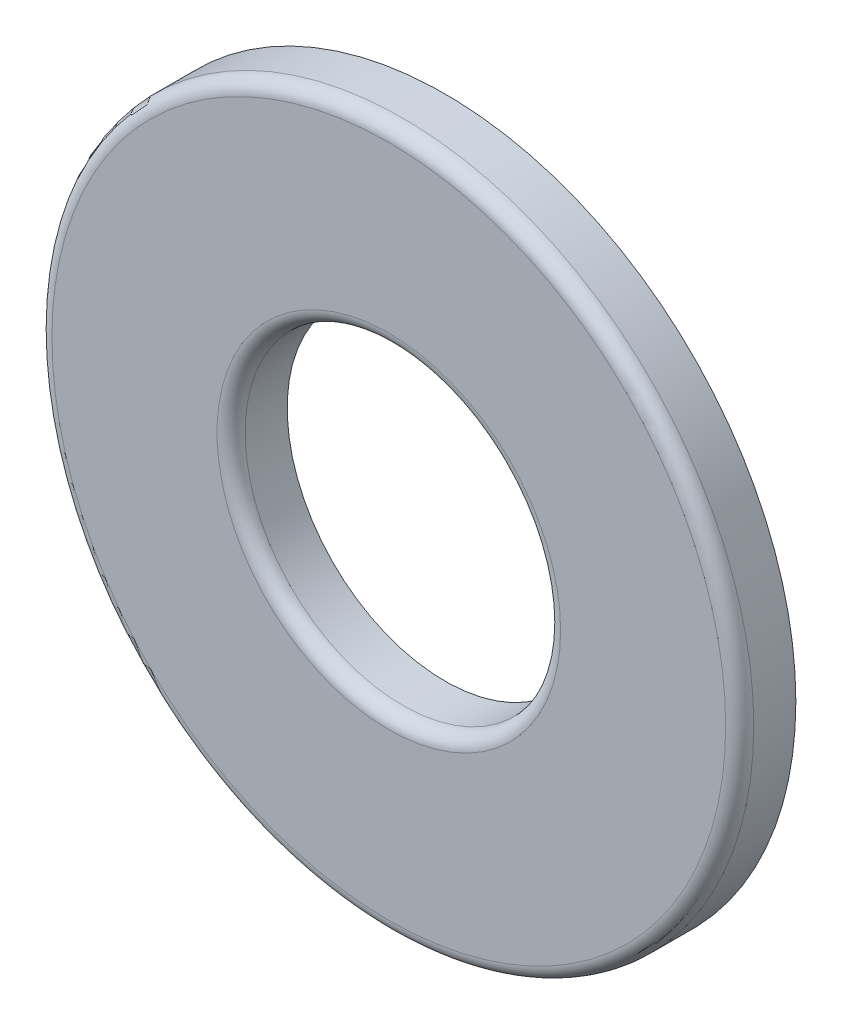
ISO-10303-21;
HEADER;
FILE_DESCRIPTION(('STEP AP214'),'2;1');
FILE_NAME('part.step','',(''),(''),'','','');
FILE_SCHEMA(('AUTOMOTIVE_DESIGN { 1 0 10303 214 1 1 1 1 }'));
ENDSEC;
DATA;
#1=APPLICATION_CONTEXT('core data for automotive mechanical design processes');
#2=APPLICATION_PROTOCOL_DEFINITION('international standard','automotive_design',2000,#1);
#3=PRODUCT_CONTEXT('',#1,'mechanical');
#4=PRODUCT('Part','Part','',(#3));
#5=PRODUCT_RELATED_PRODUCT_CATEGORY('part','',(#4));
#6=PRODUCT_DEFINITION_FORMATION('','',#4);
#7=PRODUCT_DEFINITION_CONTEXT('part definition',#1,'design');
#8=PRODUCT_DEFINITION('design','',#6,#7);
#9=PRODUCT_DEFINITION_SHAPE('','',#8);
#10=(LENGTH_UNIT() NAMED_UNIT(*) SI_UNIT(.MILLI.,.METRE.));
#11=(NAMED_UNIT(*) PLANE_ANGLE_UNIT() SI_UNIT($,.RADIAN.));
#12=(NAMED_UNIT(*) SI_UNIT($,.STERADIAN.) SOLID_ANGLE_UNIT());
#13=UNCERTAINTY_MEASURE_WITH_UNIT(LENGTH_MEASURE(1.E-05),#10,'distance_accuracy_value','');
#14=(GEOMETRIC_REPRESENTATION_CONTEXT(3) GLOBAL_UNCERTAINTY_ASSIGNED_CONTEXT((#13)) GLOBAL_UNIT_ASSIGNED_CONTEXT((#10,
#11,#12)) REPRESENTATION_CONTEXT('',''));
#15=CARTESIAN_POINT('',(0.,0.,0.));
#16=DIRECTION('',(0.,0.,1.));
#17=DIRECTION('',(1.,0.,0.));
#18=AXIS2_PLACEMENT_3D('',#15,#16,#17);
#19=CARTESIAN_POINT('',(0.,0.,0.634999999999997));
#20=DIRECTION('',(0.,0.,1.));
#21=DIRECTION('',(1.,0.,0.));
#22=AXIS2_PLACEMENT_3D('',#19,#20,#21);
#23=PLANE('',#22);
#24=CARTESIAN_POINT('',(0.,0.,0.634999999999997));
#25=DIRECTION('',(0.,0.,1.));
#26=DIRECTION('',(1.,0.,0.));
#27=AXIS2_PLACEMENT_3D('',#24,#25,#26);
#28=CIRCLE('',#27,7.62);
#29=CARTESIAN_POINT('',(7.62,0.,0.634999999999997));
#30=VERTEX_POINT('',#29);
#31=EDGE_CURVE('E48',#30,#30,#28,.T.);
#32=ORIENTED_EDGE('',*,*,#31,.T.);
#33=EDGE_LOOP('',(#32));
#34=FACE_BOUND('',#33,.T.);
#35=CARTESIAN_POINT('',(0.,0.,0.634999999999997));
#36=DIRECTION('',(0.,0.,1.));
#37=DIRECTION('',(1.,0.,0.));
#38=AXIS2_PLACEMENT_3D('',#35,#36,#37);
#39=CIRCLE('',#38,3.8862);
#40=CARTESIAN_POINT('',(3.8862,0.,0.634999999999997));
#41=VERTEX_POINT('',#40);
#42=EDGE_CURVE('E52',#41,#41,#39,.F.);
#43=ORIENTED_EDGE('',*,*,#42,.T.);
#44=EDGE_LOOP('',(#43));
#45=FACE_BOUND('',#44,.T.);
#46=ADVANCED_FACE('F37',(#34,#45),#23,.T.);
#47=CARTESIAN_POINT('',(0.,0.,0.634999999999997));
#48=DIRECTION('',(0.,0.,-1.));
#49=DIRECTION('',(-1.,0.,0.));
#50=AXIS2_PLACEMENT_3D('',#47,#48,#49);
#51=CYLINDRICAL_SURFACE('',#50,7.9375);
#52=CARTESIAN_POINT('',(0.,0.,0.317499999999997));
#53=DIRECTION('',(0.,0.,1.));
#54=DIRECTION('',(1.,0.,0.));
#55=AXIS2_PLACEMENT_3D('',#52,#53,#54);
#56=CIRCLE('',#55,7.9375);
#57=CARTESIAN_POINT('',(7.9375,0.,0.317499999999997));
#58=VERTEX_POINT('',#57);
#59=EDGE_CURVE('E44',#58,#58,#56,.F.);
#60=ORIENTED_EDGE('',*,*,#59,.T.);
#61=EDGE_LOOP('',(#60));
#62=FACE_BOUND('',#61,.T.);
#63=CARTESIAN_POINT('',(0.,0.,-0.635000000000003));
#64=DIRECTION('',(0.,0.,1.));
#65=DIRECTION('',(1.,0.,0.));
#66=AXIS2_PLACEMENT_3D('',#63,#64,#65);
#67=CIRCLE('',#66,7.9375);
#68=CARTESIAN_POINT('',(7.9375,0.,-0.635000000000003));
#69=VERTEX_POINT('',#68);
#70=EDGE_CURVE('E57',#69,#69,#67,.T.);
#71=ORIENTED_EDGE('',*,*,#70,.T.);
#72=EDGE_LOOP('',(#71));
#73=FACE_BOUND('',#72,.T.);
#74=ADVANCED_FACE('F69',(#62,#73),#51,.T.);
#75=CARTESIAN_POINT('',(0.,0.,0.634999999999997));
#76=DIRECTION('',(0.,0.,-1.));
#77=DIRECTION('',(-1.,0.,0.));
#78=AXIS2_PLACEMENT_3D('',#75,#76,#77);
#79=CYLINDRICAL_SURFACE('',#78,3.5687);
#80=CARTESIAN_POINT('',(0.,0.,0.317499999999997));
#81=DIRECTION('',(0.,0.,1.));
#82=DIRECTION('',(1.,0.,0.));
#83=AXIS2_PLACEMENT_3D('',#80,#81,#82);
#84=CIRCLE('',#83,3.5687);
#85=CARTESIAN_POINT('',(3.5687,0.,0.317499999999997));
#86=VERTEX_POINT('',#85);
#87=EDGE_CURVE('E10',#86,#86,#84,.T.);
#88=ORIENTED_EDGE('',*,*,#87,.T.);
#89=EDGE_LOOP('',(#88));
#90=FACE_BOUND('',#89,.T.);
#91=CARTESIAN_POINT('',(0.,0.,-0.635000000000003));
#92=DIRECTION('',(0.,0.,1.));
#93=DIRECTION('',(1.,0.,0.));
#94=AXIS2_PLACEMENT_3D('',#91,#92,#93);
#95=CIRCLE('',#94,3.5687);
#96=CARTESIAN_POINT('',(3.5687,0.,-0.635000000000003));
#97=VERTEX_POINT('',#96);
#98=EDGE_CURVE('E60',#97,#97,#95,.T.);
#99=ORIENTED_EDGE('',*,*,#98,.F.);
#100=EDGE_LOOP('',(#99));
#101=FACE_BOUND('',#100,.T.);
#102=ADVANCED_FACE('F67',(#90,#101),#79,.F.);
#103=CARTESIAN_POINT('',(0.,0.,-0.635000000000003));
#104=DIRECTION('',(0.,0.,1.));
#105=DIRECTION('',(1.,0.,0.));
#106=AXIS2_PLACEMENT_3D('',#103,#104,#105);
#107=PLANE('',#106);
#108=ORIENTED_EDGE('',*,*,#98,.T.);
#109=EDGE_LOOP('',(#108));
#110=FACE_BOUND('',#109,.T.);
#111=ORIENTED_EDGE('',*,*,#70,.F.);
#112=EDGE_LOOP('',(#111));
#113=FACE_BOUND('',#112,.T.);
#114=ADVANCED_FACE('F64',(#110,#113),#107,.F.);
#115=CARTESIAN_POINT('',(0.,0.,0.317499999999997));
#116=DIRECTION('',(0.,0.,1.));
#117=DIRECTION('',(1.,0.,0.));
#118=AXIS2_PLACEMENT_3D('',#115,#116,#117);
#119=TOROIDAL_SURFACE('',#118,7.62,0.3175);
#120=ORIENTED_EDGE('',*,*,#59,.F.);
#121=EDGE_LOOP('',(#120));
#122=FACE_BOUND('',#121,.T.);
#123=ORIENTED_EDGE('',*,*,#31,.F.);
#124=EDGE_LOOP('',(#123));
#125=FACE_BOUND('',#124,.T.);
#126=ADVANCED_FACE('F76',(#122,#125),#119,.T.);
#127=CARTESIAN_POINT('',(0.,0.,0.317499999999997));
#128=DIRECTION('',(0.,0.,1.));
#129=DIRECTION('',(1.,0.,0.));
#130=AXIS2_PLACEMENT_3D('',#127,#128,#129);
#131=TOROIDAL_SURFACE('',#130,3.8862,0.3175);
#132=ORIENTED_EDGE('',*,*,#42,.F.);
#133=EDGE_LOOP('',(#132));
#134=FACE_BOUND('',#133,.T.);
#135=ORIENTED_EDGE('',*,*,#87,.F.);
#136=EDGE_LOOP('',(#135));
#137=FACE_BOUND('',#136,.T.);
#138=ADVANCED_FACE('F39',(#134,#137),#131,.T.);
#139=CLOSED_SHELL('',(#46,#74,#102,#114,#126,#138));
#140=MANIFOLD_SOLID_BREP('B2',#139);
#141=ADVANCED_BREP_SHAPE_REPRESENTATION('',(#18,#140),#14);
#142=SHAPE_DEFINITION_REPRESENTATION(#9,#141);
ENDSEC;
END-ISO-10303-21;
